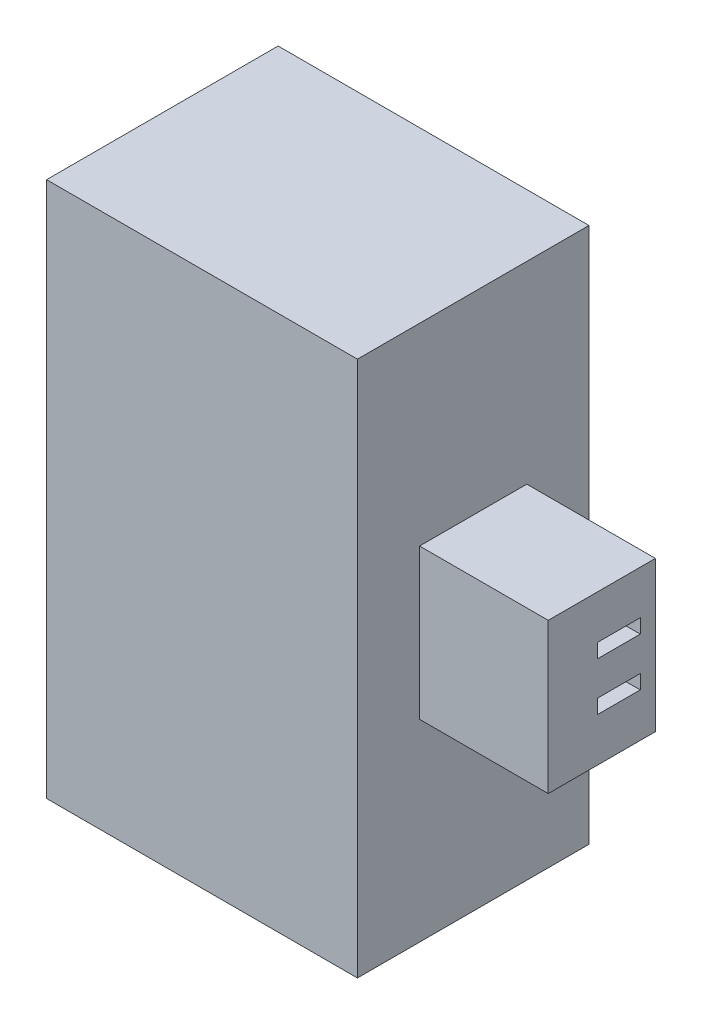
ISO-10303-21;
HEADER;
FILE_DESCRIPTION(('STEP AP214'),'2;1');
FILE_NAME('part.step','',(''),(''),'','','');
FILE_SCHEMA(('AUTOMOTIVE_DESIGN { 1 0 10303 214 1 1 1 1 }'));
ENDSEC;
DATA;
#1=APPLICATION_CONTEXT('core data for automotive mechanical design processes');
#2=APPLICATION_PROTOCOL_DEFINITION('international standard','automotive_design',2000,#1);
#3=PRODUCT_CONTEXT('',#1,'mechanical');
#4=PRODUCT('Part','Part','',(#3));
#5=PRODUCT_RELATED_PRODUCT_CATEGORY('part','',(#4));
#6=PRODUCT_DEFINITION_FORMATION('','',#4);
#7=PRODUCT_DEFINITION_CONTEXT('part definition',#1,'design');
#8=PRODUCT_DEFINITION('design','',#6,#7);
#9=PRODUCT_DEFINITION_SHAPE('','',#8);
#10=(LENGTH_UNIT() NAMED_UNIT(*) SI_UNIT(.MILLI.,.METRE.));
#11=(NAMED_UNIT(*) PLANE_ANGLE_UNIT() SI_UNIT($,.RADIAN.));
#12=(NAMED_UNIT(*) SI_UNIT($,.STERADIAN.) SOLID_ANGLE_UNIT());
#13=UNCERTAINTY_MEASURE_WITH_UNIT(LENGTH_MEASURE(1.E-05),#10,'distance_accuracy_value','');
#14=(GEOMETRIC_REPRESENTATION_CONTEXT(3) GLOBAL_UNCERTAINTY_ASSIGNED_CONTEXT((#13)) GLOBAL_UNIT_ASSIGNED_CONTEXT((#10,
#11,#12)) REPRESENTATION_CONTEXT('',''));
#15=CARTESIAN_POINT('',(0.,0.,0.));
#16=DIRECTION('',(0.,0.,1.));
#17=DIRECTION('',(1.,0.,0.));
#18=AXIS2_PLACEMENT_3D('',#15,#16,#17);
#19=CARTESIAN_POINT('',(7.25,0.,5.4));
#20=DIRECTION('',(-1.,0.,0.));
#21=DIRECTION('',(0.,0.,1.));
#22=AXIS2_PLACEMENT_3D('',#19,#20,#21);
#23=PLANE('',#22);
#24=DIRECTION('',(0.,1.,0.));
#25=VECTOR('',#24,1.);
#26=CARTESIAN_POINT('',(7.25,0.,0.));
#27=LINE('',#26,#25);
#28=CARTESIAN_POINT('',(7.25,0.,0.));
#29=VERTEX_POINT('',#28);
#30=CARTESIAN_POINT('',(7.25,12.5,0.));
#31=VERTEX_POINT('',#30);
#32=EDGE_CURVE('E259',#29,#31,#27,.T.);
#33=ORIENTED_EDGE('',*,*,#32,.T.);
#34=DIRECTION('',(0.,0.,-1.));
#35=VECTOR('',#34,1.);
#36=CARTESIAN_POINT('',(7.25,12.5,5.4));
#37=LINE('',#36,#35);
#38=CARTESIAN_POINT('',(7.25,12.5,5.4));
#39=VERTEX_POINT('',#38);
#40=EDGE_CURVE('E264',#39,#31,#37,.T.);
#41=ORIENTED_EDGE('',*,*,#40,.F.);
#42=DIRECTION('',(0.,1.,0.));
#43=VECTOR('',#42,1.);
#44=CARTESIAN_POINT('',(7.25,0.,5.4));
#45=LINE('',#44,#43);
#46=CARTESIAN_POINT('',(7.25,0.,5.4));
#47=VERTEX_POINT('',#46);
#48=EDGE_CURVE('E250',#47,#39,#45,.T.);
#49=ORIENTED_EDGE('',*,*,#48,.F.);
#50=DIRECTION('',(0.,0.,-1.));
#51=VECTOR('',#50,1.);
#52=CARTESIAN_POINT('',(7.25,0.,5.4));
#53=LINE('',#52,#51);
#54=EDGE_CURVE('E40',#47,#29,#53,.T.);
#55=ORIENTED_EDGE('',*,*,#54,.T.);
#56=EDGE_LOOP('',(#33,#41,#49,#55));
#57=FACE_BOUND('',#56,.T.);
#58=DIRECTION('',(0.,-1.,0.));
#59=VECTOR('',#58,1.);
#60=CARTESIAN_POINT('',(7.25,8.,3.95));
#61=LINE('',#60,#59);
#62=CARTESIAN_POINT('',(7.25,8.,3.95));
#63=VERTEX_POINT('',#62);
#64=CARTESIAN_POINT('',(7.25,4.5,3.95));
#65=VERTEX_POINT('',#64);
#66=EDGE_CURVE('E215',#63,#65,#61,.T.);
#67=ORIENTED_EDGE('',*,*,#66,.F.);
#68=DIRECTION('',(0.,0.,1.));
#69=VECTOR('',#68,1.);
#70=CARTESIAN_POINT('',(7.25,8.,3.95));
#71=LINE('',#70,#69);
#72=CARTESIAN_POINT('',(7.25,8.,1.45));
#73=VERTEX_POINT('',#72);
#74=EDGE_CURVE('E220',#73,#63,#71,.T.);
#75=ORIENTED_EDGE('',*,*,#74,.F.);
#76=DIRECTION('',(0.,1.,0.));
#77=VECTOR('',#76,1.);
#78=CARTESIAN_POINT('',(7.25,8.,1.45));
#79=LINE('',#78,#77);
#80=CARTESIAN_POINT('',(7.25,4.5,1.45));
#81=VERTEX_POINT('',#80);
#82=EDGE_CURVE('E52',#81,#73,#79,.T.);
#83=ORIENTED_EDGE('',*,*,#82,.F.);
#84=DIRECTION('',(0.,0.,-1.));
#85=VECTOR('',#84,1.);
#86=CARTESIAN_POINT('',(7.25,4.5,3.95));
#87=LINE('',#86,#85);
#88=EDGE_CURVE('E47',#65,#81,#87,.T.);
#89=ORIENTED_EDGE('',*,*,#88,.F.);
#90=EDGE_LOOP('',(#67,#75,#83,#89));
#91=FACE_BOUND('',#90,.T.);
#92=ADVANCED_FACE('F32',(#57,#91),#23,.F.);
#93=CARTESIAN_POINT('',(0.,0.,5.4));
#94=DIRECTION('',(1.,0.,0.));
#95=DIRECTION('',(0.,0.,-1.));
#96=AXIS2_PLACEMENT_3D('',#93,#94,#95);
#97=PLANE('',#96);
#98=DIRECTION('',(0.,-1.,0.));
#99=VECTOR('',#98,1.);
#100=CARTESIAN_POINT('',(0.,0.,0.));
#101=LINE('',#100,#99);
#102=CARTESIAN_POINT('',(0.,12.5,0.));
#103=VERTEX_POINT('',#102);
#104=CARTESIAN_POINT('',(0.,0.,0.));
#105=VERTEX_POINT('',#104);
#106=EDGE_CURVE('E243',#103,#105,#101,.T.);
#107=ORIENTED_EDGE('',*,*,#106,.T.);
#108=DIRECTION('',(0.,0.,-1.));
#109=VECTOR('',#108,1.);
#110=CARTESIAN_POINT('',(0.,0.,5.4));
#111=LINE('',#110,#109);
#112=CARTESIAN_POINT('',(0.,0.,5.4));
#113=VERTEX_POINT('',#112);
#114=EDGE_CURVE('E11',#113,#105,#111,.T.);
#115=ORIENTED_EDGE('',*,*,#114,.F.);
#116=DIRECTION('',(0.,-1.,0.));
#117=VECTOR('',#116,1.);
#118=CARTESIAN_POINT('',(0.,0.,5.4));
#119=LINE('',#118,#117);
#120=CARTESIAN_POINT('',(0.,12.5,5.4));
#121=VERTEX_POINT('',#120);
#122=EDGE_CURVE('E244',#121,#113,#119,.T.);
#123=ORIENTED_EDGE('',*,*,#122,.F.);
#124=DIRECTION('',(0.,0.,-1.));
#125=VECTOR('',#124,1.);
#126=CARTESIAN_POINT('',(0.,12.5,5.4));
#127=LINE('',#126,#125);
#128=EDGE_CURVE('E254',#121,#103,#127,.T.);
#129=ORIENTED_EDGE('',*,*,#128,.T.);
#130=EDGE_LOOP('',(#107,#115,#123,#129));
#131=FACE_BOUND('',#130,.T.);
#132=ADVANCED_FACE('F34',(#131),#97,.F.);
#133=CARTESIAN_POINT('',(0.,0.,5.4));
#134=DIRECTION('',(0.,1.,0.));
#135=DIRECTION('',(0.,0.,1.));
#136=AXIS2_PLACEMENT_3D('',#133,#134,#135);
#137=PLANE('',#136);
#138=DIRECTION('',(1.,0.,0.));
#139=VECTOR('',#138,1.);
#140=CARTESIAN_POINT('',(0.,0.,0.));
#141=LINE('',#140,#139);
#142=EDGE_CURVE('E257',#105,#29,#141,.T.);
#143=ORIENTED_EDGE('',*,*,#142,.T.);
#144=ORIENTED_EDGE('',*,*,#54,.F.);
#145=DIRECTION('',(1.,0.,0.));
#146=VECTOR('',#145,1.);
#147=CARTESIAN_POINT('',(0.,0.,5.4));
#148=LINE('',#147,#146);
#149=EDGE_CURVE('E247',#113,#47,#148,.T.);
#150=ORIENTED_EDGE('',*,*,#149,.F.);
#151=ORIENTED_EDGE('',*,*,#114,.T.);
#152=EDGE_LOOP('',(#143,#144,#150,#151));
#153=FACE_BOUND('',#152,.T.);
#154=ADVANCED_FACE('F286',(#153),#137,.F.);
#155=CARTESIAN_POINT('',(0.,12.5,5.4));
#156=DIRECTION('',(0.,-1.,0.));
#157=DIRECTION('',(0.,0.,-1.));
#158=AXIS2_PLACEMENT_3D('',#155,#156,#157);
#159=PLANE('',#158);
#160=DIRECTION('',(-1.,0.,0.));
#161=VECTOR('',#160,1.);
#162=CARTESIAN_POINT('',(0.,12.5,0.));
#163=LINE('',#162,#161);
#164=EDGE_CURVE('E248',#31,#103,#163,.T.);
#165=ORIENTED_EDGE('',*,*,#164,.T.);
#166=ORIENTED_EDGE('',*,*,#128,.F.);
#167=DIRECTION('',(-1.,0.,0.));
#168=VECTOR('',#167,1.);
#169=CARTESIAN_POINT('',(0.,12.5,5.4));
#170=LINE('',#169,#168);
#171=EDGE_CURVE('E252',#39,#121,#170,.T.);
#172=ORIENTED_EDGE('',*,*,#171,.F.);
#173=ORIENTED_EDGE('',*,*,#40,.T.);
#174=EDGE_LOOP('',(#165,#166,#172,#173));
#175=FACE_BOUND('',#174,.T.);
#176=ADVANCED_FACE('F279',(#175),#159,.F.);
#177=CARTESIAN_POINT('',(0.,0.,5.4));
#178=DIRECTION('',(0.,0.,-1.));
#179=DIRECTION('',(-1.,0.,0.));
#180=AXIS2_PLACEMENT_3D('',#177,#178,#179);
#181=PLANE('',#180);
#182=ORIENTED_EDGE('',*,*,#122,.T.);
#183=ORIENTED_EDGE('',*,*,#149,.T.);
#184=ORIENTED_EDGE('',*,*,#48,.T.);
#185=ORIENTED_EDGE('',*,*,#171,.T.);
#186=EDGE_LOOP('',(#182,#183,#184,#185));
#187=FACE_BOUND('',#186,.T.);
#188=ADVANCED_FACE('F285',(#187),#181,.F.);
#189=CARTESIAN_POINT('',(0.,0.,0.));
#190=DIRECTION('',(0.,0.,-1.));
#191=DIRECTION('',(-1.,0.,0.));
#192=AXIS2_PLACEMENT_3D('',#189,#190,#191);
#193=PLANE('',#192);
#194=ORIENTED_EDGE('',*,*,#106,.F.);
#195=ORIENTED_EDGE('',*,*,#164,.F.);
#196=ORIENTED_EDGE('',*,*,#32,.F.);
#197=ORIENTED_EDGE('',*,*,#142,.F.);
#198=EDGE_LOOP('',(#194,#195,#196,#197));
#199=FACE_BOUND('',#198,.T.);
#200=ADVANCED_FACE('F276',(#199),#193,.T.);
#201=CARTESIAN_POINT('',(10.25,0.,0.));
#202=DIRECTION('',(1.,0.,0.));
#203=DIRECTION('',(0.,0.,-1.));
#204=AXIS2_PLACEMENT_3D('',#201,#202,#203);
#205=PLANE('',#204);
#206=DIRECTION('',(0.,-1.,0.));
#207=VECTOR('',#206,1.);
#208=CARTESIAN_POINT('',(10.25,8.,3.95));
#209=LINE('',#208,#207);
#210=CARTESIAN_POINT('',(10.25,8.,3.95));
#211=VERTEX_POINT('',#210);
#212=CARTESIAN_POINT('',(10.25,4.5,3.95));
#213=VERTEX_POINT('',#212);
#214=EDGE_CURVE('E216',#211,#213,#209,.T.);
#215=ORIENTED_EDGE('',*,*,#214,.T.);
#216=DIRECTION('',(0.,0.,-1.));
#217=VECTOR('',#216,1.);
#218=CARTESIAN_POINT('',(10.25,4.5,3.95));
#219=LINE('',#218,#217);
#220=CARTESIAN_POINT('',(10.25,4.5,1.45));
#221=VERTEX_POINT('',#220);
#222=EDGE_CURVE('E219',#213,#221,#219,.T.);
#223=ORIENTED_EDGE('',*,*,#222,.T.);
#224=DIRECTION('',(0.,1.,0.));
#225=VECTOR('',#224,1.);
#226=CARTESIAN_POINT('',(10.25,8.,1.45));
#227=LINE('',#226,#225);
#228=CARTESIAN_POINT('',(10.25,8.,1.45));
#229=VERTEX_POINT('',#228);
#230=EDGE_CURVE('E222',#221,#229,#227,.T.);
#231=ORIENTED_EDGE('',*,*,#230,.T.);
#232=DIRECTION('',(0.,0.,1.));
#233=VECTOR('',#232,1.);
#234=CARTESIAN_POINT('',(10.25,8.,3.95));
#235=LINE('',#234,#233);
#236=EDGE_CURVE('E224',#229,#211,#235,.T.);
#237=ORIENTED_EDGE('',*,*,#236,.T.);
#238=EDGE_LOOP('',(#215,#223,#231,#237));
#239=FACE_BOUND('',#238,.T.);
#240=DIRECTION('',(0.,0.,-1.));
#241=VECTOR('',#240,1.);
#242=CARTESIAN_POINT('',(10.25,6.64774485482273,2.80366487818985));
#243=LINE('',#242,#241);
#244=CARTESIAN_POINT('',(10.25,6.64774485482273,2.80366487818985));
#245=VERTEX_POINT('',#244);
#246=CARTESIAN_POINT('',(10.25,6.64774485482273,1.80366487818985));
#247=VERTEX_POINT('',#246);
#248=EDGE_CURVE('E188',#245,#247,#243,.T.);
#249=ORIENTED_EDGE('',*,*,#248,.F.);
#250=DIRECTION('',(0.,-1.,0.));
#251=VECTOR('',#250,1.);
#252=CARTESIAN_POINT('',(10.25,6.97909511054018,2.80366487818985));
#253=LINE('',#252,#251);
#254=CARTESIAN_POINT('',(10.25,6.97909511054018,2.80366487818985));
#255=VERTEX_POINT('',#254);
#256=EDGE_CURVE('E186',#255,#245,#253,.T.);
#257=ORIENTED_EDGE('',*,*,#256,.F.);
#258=DIRECTION('',(0.,0.,1.));
#259=VECTOR('',#258,1.);
#260=CARTESIAN_POINT('',(10.25,6.97909511054018,2.80366487818985));
#261=LINE('',#260,#259);
#262=CARTESIAN_POINT('',(10.25,6.97909511054018,1.80366487818985));
#263=VERTEX_POINT('',#262);
#264=EDGE_CURVE('E194',#263,#255,#261,.T.);
#265=ORIENTED_EDGE('',*,*,#264,.F.);
#266=DIRECTION('',(0.,1.,0.));
#267=VECTOR('',#266,1.);
#268=CARTESIAN_POINT('',(10.25,6.97909511054018,1.80366487818985));
#269=LINE('',#268,#267);
#270=EDGE_CURVE('E191',#247,#263,#269,.T.);
#271=ORIENTED_EDGE('',*,*,#270,.F.);
#272=EDGE_LOOP('',(#249,#257,#265,#271));
#273=FACE_BOUND('',#272,.T.);
#274=DIRECTION('',(0.,1.,0.));
#275=VECTOR('',#274,1.);
#276=CARTESIAN_POINT('',(10.25,5.52090488945982,1.80366487818985));
#277=LINE('',#276,#275);
#278=CARTESIAN_POINT('',(10.25,5.52090488945982,1.80366487818985));
#279=VERTEX_POINT('',#278);
#280=CARTESIAN_POINT('',(10.25,5.85225514517727,1.80366487818985));
#281=VERTEX_POINT('',#280);
#282=EDGE_CURVE('E154',#279,#281,#277,.T.);
#283=ORIENTED_EDGE('',*,*,#282,.F.);
#284=DIRECTION('',(0.,0.,-1.));
#285=VECTOR('',#284,1.);
#286=CARTESIAN_POINT('',(10.25,5.52090488945982,2.80366487818985));
#287=LINE('',#286,#285);
#288=CARTESIAN_POINT('',(10.25,5.52090488945982,2.80366487818985));
#289=VERTEX_POINT('',#288);
#290=EDGE_CURVE('E144',#289,#279,#287,.T.);
#291=ORIENTED_EDGE('',*,*,#290,.F.);
#292=DIRECTION('',(0.,-1.,0.));
#293=VECTOR('',#292,1.);
#294=CARTESIAN_POINT('',(10.25,5.52090488945982,2.80366487818985));
#295=LINE('',#294,#293);
#296=CARTESIAN_POINT('',(10.25,5.85225514517727,2.80366487818985));
#297=VERTEX_POINT('',#296);
#298=EDGE_CURVE('E170',#297,#289,#295,.T.);
#299=ORIENTED_EDGE('',*,*,#298,.F.);
#300=DIRECTION('',(0.,0.,1.));
#301=VECTOR('',#300,1.);
#302=CARTESIAN_POINT('',(10.25,5.85225514517727,2.80366487818985));
#303=LINE('',#302,#301);
#304=EDGE_CURVE('E168',#281,#297,#303,.T.);
#305=ORIENTED_EDGE('',*,*,#304,.F.);
#306=EDGE_LOOP('',(#283,#291,#299,#305));
#307=FACE_BOUND('',#306,.T.);
#308=ADVANCED_FACE('F166',(#239,#273,#307),#205,.T.);
#309=CARTESIAN_POINT('',(10.25,8.,3.95));
#310=DIRECTION('',(0.,0.,-1.));
#311=DIRECTION('',(-1.,0.,0.));
#312=AXIS2_PLACEMENT_3D('',#309,#310,#311);
#313=PLANE('',#312);
#314=ORIENTED_EDGE('',*,*,#66,.T.);
#315=DIRECTION('',(-1.,0.,0.));
#316=VECTOR('',#315,1.);
#317=CARTESIAN_POINT('',(10.25,4.5,3.95));
#318=LINE('',#317,#316);
#319=EDGE_CURVE('E241',#213,#65,#318,.T.);
#320=ORIENTED_EDGE('',*,*,#319,.F.);
#321=ORIENTED_EDGE('',*,*,#214,.F.);
#322=DIRECTION('',(-1.,0.,0.));
#323=VECTOR('',#322,1.);
#324=CARTESIAN_POINT('',(10.25,8.,3.95));
#325=LINE('',#324,#323);
#326=EDGE_CURVE('E226',#211,#63,#325,.T.);
#327=ORIENTED_EDGE('',*,*,#326,.T.);
#328=EDGE_LOOP('',(#314,#320,#321,#327));
#329=FACE_BOUND('',#328,.T.);
#330=ADVANCED_FACE('F341',(#329),#313,.F.);
#331=CARTESIAN_POINT('',(10.25,4.5,3.95));
#332=DIRECTION('',(0.,1.,0.));
#333=DIRECTION('',(0.,0.,1.));
#334=AXIS2_PLACEMENT_3D('',#331,#332,#333);
#335=PLANE('',#334);
#336=ORIENTED_EDGE('',*,*,#88,.T.);
#337=DIRECTION('',(-1.,0.,0.));
#338=VECTOR('',#337,1.);
#339=CARTESIAN_POINT('',(10.25,4.5,1.45));
#340=LINE('',#339,#338);
#341=EDGE_CURVE('E238',#221,#81,#340,.T.);
#342=ORIENTED_EDGE('',*,*,#341,.F.);
#343=ORIENTED_EDGE('',*,*,#222,.F.);
#344=ORIENTED_EDGE('',*,*,#319,.T.);
#345=EDGE_LOOP('',(#336,#342,#343,#344));
#346=FACE_BOUND('',#345,.T.);
#347=ADVANCED_FACE('F349',(#346),#335,.F.);
#348=CARTESIAN_POINT('',(10.25,8.,1.45));
#349=DIRECTION('',(0.,0.,1.));
#350=DIRECTION('',(1.,0.,0.));
#351=AXIS2_PLACEMENT_3D('',#348,#349,#350);
#352=PLANE('',#351);
#353=ORIENTED_EDGE('',*,*,#82,.T.);
#354=DIRECTION('',(-1.,0.,0.));
#355=VECTOR('',#354,1.);
#356=CARTESIAN_POINT('',(10.25,8.,1.45));
#357=LINE('',#356,#355);
#358=EDGE_CURVE('E235',#229,#73,#357,.T.);
#359=ORIENTED_EDGE('',*,*,#358,.F.);
#360=ORIENTED_EDGE('',*,*,#230,.F.);
#361=ORIENTED_EDGE('',*,*,#341,.T.);
#362=EDGE_LOOP('',(#353,#359,#360,#361));
#363=FACE_BOUND('',#362,.T.);
#364=ADVANCED_FACE('F345',(#363),#352,.F.);
#365=CARTESIAN_POINT('',(10.25,8.,3.95));
#366=DIRECTION('',(0.,-1.,0.));
#367=DIRECTION('',(0.,0.,-1.));
#368=AXIS2_PLACEMENT_3D('',#365,#366,#367);
#369=PLANE('',#368);
#370=ORIENTED_EDGE('',*,*,#74,.T.);
#371=ORIENTED_EDGE('',*,*,#326,.F.);
#372=ORIENTED_EDGE('',*,*,#236,.F.);
#373=ORIENTED_EDGE('',*,*,#358,.T.);
#374=EDGE_LOOP('',(#370,#371,#372,#373));
#375=FACE_BOUND('',#374,.T.);
#376=ADVANCED_FACE('F337',(#375),#369,.F.);
#377=CARTESIAN_POINT('',(10.25,6.97909511054018,2.80366487818985));
#378=DIRECTION('',(0.,0.,-1.));
#379=DIRECTION('',(-1.,0.,0.));
#380=AXIS2_PLACEMENT_3D('',#377,#378,#379);
#381=PLANE('',#380);
#382=DIRECTION('',(0.,-1.,0.));
#383=VECTOR('',#382,1.);
#384=CARTESIAN_POINT('',(7.25,6.97909511054018,2.80366487818985));
#385=LINE('',#384,#383);
#386=CARTESIAN_POINT('',(7.25,6.97909511054018,2.80366487818985));
#387=VERTEX_POINT('',#386);
#388=CARTESIAN_POINT('',(7.25,6.64774485482273,2.80366487818985));
#389=VERTEX_POINT('',#388);
#390=EDGE_CURVE('E162',#387,#389,#385,.T.);
#391=ORIENTED_EDGE('',*,*,#390,.F.);
#392=DIRECTION('',(-1.,0.,0.));
#393=VECTOR('',#392,1.);
#394=CARTESIAN_POINT('',(10.25,6.97909511054018,2.80366487818985));
#395=LINE('',#394,#393);
#396=EDGE_CURVE('E196',#255,#387,#395,.T.);
#397=ORIENTED_EDGE('',*,*,#396,.F.);
#398=ORIENTED_EDGE('',*,*,#256,.T.);
#399=DIRECTION('',(-1.,0.,0.));
#400=VECTOR('',#399,1.);
#401=CARTESIAN_POINT('',(10.25,6.64774485482273,2.80366487818985));
#402=LINE('',#401,#400);
#403=EDGE_CURVE('E212',#245,#389,#402,.T.);
#404=ORIENTED_EDGE('',*,*,#403,.T.);
#405=EDGE_LOOP('',(#391,#397,#398,#404));
#406=FACE_BOUND('',#405,.T.);
#407=ADVANCED_FACE('F333',(#406),#381,.T.);
#408=CARTESIAN_POINT('',(10.25,6.64774485482273,2.80366487818985));
#409=DIRECTION('',(0.,1.,0.));
#410=DIRECTION('',(0.,0.,1.));
#411=AXIS2_PLACEMENT_3D('',#408,#409,#410);
#412=PLANE('',#411);
#413=DIRECTION('',(0.,0.,-1.));
#414=VECTOR('',#413,1.);
#415=CARTESIAN_POINT('',(7.25,6.64774485482273,2.80366487818985));
#416=LINE('',#415,#414);
#417=CARTESIAN_POINT('',(7.25,6.64774485482273,1.80366487818985));
#418=VERTEX_POINT('',#417);
#419=EDGE_CURVE('E199',#389,#418,#416,.T.);
#420=ORIENTED_EDGE('',*,*,#419,.F.);
#421=ORIENTED_EDGE('',*,*,#403,.F.);
#422=ORIENTED_EDGE('',*,*,#248,.T.);
#423=DIRECTION('',(-1.,0.,0.));
#424=VECTOR('',#423,1.);
#425=CARTESIAN_POINT('',(10.25,6.64774485482273,1.80366487818985));
#426=LINE('',#425,#424);
#427=EDGE_CURVE('E210',#247,#418,#426,.T.);
#428=ORIENTED_EDGE('',*,*,#427,.T.);
#429=EDGE_LOOP('',(#420,#421,#422,#428));
#430=FACE_BOUND('',#429,.T.);
#431=ADVANCED_FACE('F329',(#430),#412,.T.);
#432=CARTESIAN_POINT('',(10.25,6.97909511054018,1.80366487818985));
#433=DIRECTION('',(0.,0.,1.));
#434=DIRECTION('',(1.,0.,0.));
#435=AXIS2_PLACEMENT_3D('',#432,#433,#434);
#436=PLANE('',#435);
#437=DIRECTION('',(0.,1.,0.));
#438=VECTOR('',#437,1.);
#439=CARTESIAN_POINT('',(7.25,6.97909511054018,1.80366487818985));
#440=LINE('',#439,#438);
#441=CARTESIAN_POINT('',(7.25,6.97909511054018,1.80366487818985));
#442=VERTEX_POINT('',#441);
#443=EDGE_CURVE('E202',#418,#442,#440,.T.);
#444=ORIENTED_EDGE('',*,*,#443,.F.);
#445=ORIENTED_EDGE('',*,*,#427,.F.);
#446=ORIENTED_EDGE('',*,*,#270,.T.);
#447=DIRECTION('',(-1.,0.,0.));
#448=VECTOR('',#447,1.);
#449=CARTESIAN_POINT('',(10.25,6.97909511054018,1.80366487818985));
#450=LINE('',#449,#448);
#451=EDGE_CURVE('E208',#263,#442,#450,.T.);
#452=ORIENTED_EDGE('',*,*,#451,.T.);
#453=EDGE_LOOP('',(#444,#445,#446,#452));
#454=FACE_BOUND('',#453,.T.);
#455=ADVANCED_FACE('F325',(#454),#436,.T.);
#456=CARTESIAN_POINT('',(10.25,6.97909511054018,2.80366487818985));
#457=DIRECTION('',(0.,-1.,0.));
#458=DIRECTION('',(0.,0.,-1.));
#459=AXIS2_PLACEMENT_3D('',#456,#457,#458);
#460=PLANE('',#459);
#461=DIRECTION('',(0.,0.,1.));
#462=VECTOR('',#461,1.);
#463=CARTESIAN_POINT('',(7.25,6.97909511054018,2.80366487818985));
#464=LINE('',#463,#462);
#465=EDGE_CURVE('E189',#442,#387,#464,.T.);
#466=ORIENTED_EDGE('',*,*,#465,.F.);
#467=ORIENTED_EDGE('',*,*,#451,.F.);
#468=ORIENTED_EDGE('',*,*,#264,.T.);
#469=ORIENTED_EDGE('',*,*,#396,.T.);
#470=EDGE_LOOP('',(#466,#467,#468,#469));
#471=FACE_BOUND('',#470,.T.);
#472=ADVANCED_FACE('F322',(#471),#460,.T.);
#473=CARTESIAN_POINT('',(10.25,5.52090488945982,2.80366487818985));
#474=DIRECTION('',(0.,1.,0.));
#475=DIRECTION('',(0.,0.,1.));
#476=AXIS2_PLACEMENT_3D('',#473,#474,#475);
#477=PLANE('',#476);
#478=DIRECTION('',(0.,0.,-1.));
#479=VECTOR('',#478,1.);
#480=CARTESIAN_POINT('',(7.25,5.52090488945982,2.80366487818985));
#481=LINE('',#480,#479);
#482=CARTESIAN_POINT('',(7.25,5.52090488945982,2.80366487818985));
#483=VERTEX_POINT('',#482);
#484=CARTESIAN_POINT('',(7.25,5.52090488945982,1.80366487818985));
#485=VERTEX_POINT('',#484);
#486=EDGE_CURVE('E174',#483,#485,#481,.T.);
#487=ORIENTED_EDGE('',*,*,#486,.F.);
#488=DIRECTION('',(-1.,0.,0.));
#489=VECTOR('',#488,1.);
#490=CARTESIAN_POINT('',(10.25,5.52090488945982,2.80366487818985));
#491=LINE('',#490,#489);
#492=EDGE_CURVE('E150',#289,#483,#491,.T.);
#493=ORIENTED_EDGE('',*,*,#492,.F.);
#494=ORIENTED_EDGE('',*,*,#290,.T.);
#495=DIRECTION('',(-1.,0.,0.));
#496=VECTOR('',#495,1.);
#497=CARTESIAN_POINT('',(10.25,5.52090488945982,1.80366487818985));
#498=LINE('',#497,#496);
#499=EDGE_CURVE('E148',#279,#485,#498,.T.);
#500=ORIENTED_EDGE('',*,*,#499,.T.);
#501=EDGE_LOOP('',(#487,#493,#494,#500));
#502=FACE_BOUND('',#501,.T.);
#503=ADVANCED_FACE('F147',(#502),#477,.T.);
#504=CARTESIAN_POINT('',(10.25,5.52090488945982,1.80366487818985));
#505=DIRECTION('',(0.,0.,1.));
#506=DIRECTION('',(1.,0.,0.));
#507=AXIS2_PLACEMENT_3D('',#504,#505,#506);
#508=PLANE('',#507);
#509=DIRECTION('',(0.,1.,0.));
#510=VECTOR('',#509,1.);
#511=CARTESIAN_POINT('',(7.25,5.52090488945982,1.80366487818985));
#512=LINE('',#511,#510);
#513=CARTESIAN_POINT('',(7.25,5.85225514517727,1.80366487818985));
#514=VERTEX_POINT('',#513);
#515=EDGE_CURVE('E161',#485,#514,#512,.T.);
#516=ORIENTED_EDGE('',*,*,#515,.F.);
#517=ORIENTED_EDGE('',*,*,#499,.F.);
#518=ORIENTED_EDGE('',*,*,#282,.T.);
#519=DIRECTION('',(-1.,0.,0.));
#520=VECTOR('',#519,1.);
#521=CARTESIAN_POINT('',(10.25,5.85225514517727,1.80366487818985));
#522=LINE('',#521,#520);
#523=EDGE_CURVE('E163',#281,#514,#522,.T.);
#524=ORIENTED_EDGE('',*,*,#523,.T.);
#525=EDGE_LOOP('',(#516,#517,#518,#524));
#526=FACE_BOUND('',#525,.T.);
#527=ADVANCED_FACE('F158',(#526),#508,.T.);
#528=CARTESIAN_POINT('',(10.25,5.85225514517727,2.80366487818985));
#529=DIRECTION('',(0.,-1.,0.));
#530=DIRECTION('',(0.,0.,-1.));
#531=AXIS2_PLACEMENT_3D('',#528,#529,#530);
#532=PLANE('',#531);
#533=DIRECTION('',(0.,0.,1.));
#534=VECTOR('',#533,1.);
#535=CARTESIAN_POINT('',(7.25,5.85225514517727,2.80366487818985));
#536=LINE('',#535,#534);
#537=CARTESIAN_POINT('',(7.25,5.85225514517727,2.80366487818985));
#538=VERTEX_POINT('',#537);
#539=EDGE_CURVE('E177',#514,#538,#536,.T.);
#540=ORIENTED_EDGE('',*,*,#539,.F.);
#541=ORIENTED_EDGE('',*,*,#523,.F.);
#542=ORIENTED_EDGE('',*,*,#304,.T.);
#543=DIRECTION('',(-1.,0.,0.));
#544=VECTOR('',#543,1.);
#545=CARTESIAN_POINT('',(10.25,5.85225514517727,2.80366487818985));
#546=LINE('',#545,#544);
#547=EDGE_CURVE('E183',#297,#538,#546,.T.);
#548=ORIENTED_EDGE('',*,*,#547,.T.);
#549=EDGE_LOOP('',(#540,#541,#542,#548));
#550=FACE_BOUND('',#549,.T.);
#551=ADVANCED_FACE('F310',(#550),#532,.T.);
#552=CARTESIAN_POINT('',(10.25,5.52090488945982,2.80366487818985));
#553=DIRECTION('',(0.,0.,-1.));
#554=DIRECTION('',(-1.,0.,0.));
#555=AXIS2_PLACEMENT_3D('',#552,#553,#554);
#556=PLANE('',#555);
#557=DIRECTION('',(0.,-1.,0.));
#558=VECTOR('',#557,1.);
#559=CARTESIAN_POINT('',(7.25,5.52090488945982,2.80366487818985));
#560=LINE('',#559,#558);
#561=EDGE_CURVE('E155',#538,#483,#560,.T.);
#562=ORIENTED_EDGE('',*,*,#561,.F.);
#563=ORIENTED_EDGE('',*,*,#547,.F.);
#564=ORIENTED_EDGE('',*,*,#298,.T.);
#565=ORIENTED_EDGE('',*,*,#492,.T.);
#566=EDGE_LOOP('',(#562,#563,#564,#565));
#567=FACE_BOUND('',#566,.T.);
#568=ADVANCED_FACE('F300',(#567),#556,.T.);
#569=ORIENTED_EDGE('',*,*,#465,.T.);
#570=ORIENTED_EDGE('',*,*,#390,.T.);
#571=ORIENTED_EDGE('',*,*,#419,.T.);
#572=ORIENTED_EDGE('',*,*,#443,.T.);
#573=EDGE_LOOP('',(#569,#570,#571,#572));
#574=FACE_BOUND('',#573,.T.);
#575=ADVANCED_FACE('F295',(#574),#23,.F.);
#576=ORIENTED_EDGE('',*,*,#561,.T.);
#577=ORIENTED_EDGE('',*,*,#486,.T.);
#578=ORIENTED_EDGE('',*,*,#515,.T.);
#579=ORIENTED_EDGE('',*,*,#539,.T.);
#580=EDGE_LOOP('',(#576,#577,#578,#579));
#581=FACE_BOUND('',#580,.T.);
#582=ADVANCED_FACE('F296',(#581),#23,.F.);
#583=CLOSED_SHELL('',(#92,#132,#154,#176,#188,#200,#308,#330,#347,#364,#376,#407,#431,#455,#472,
#503,#527,#551,#568,#575,#582));
#584=MANIFOLD_SOLID_BREP('B2',#583);
#585=ADVANCED_BREP_SHAPE_REPRESENTATION('',(#18,#584),#14);
#586=SHAPE_DEFINITION_REPRESENTATION(#9,#585);
ENDSEC;
END-ISO-10303-21;
